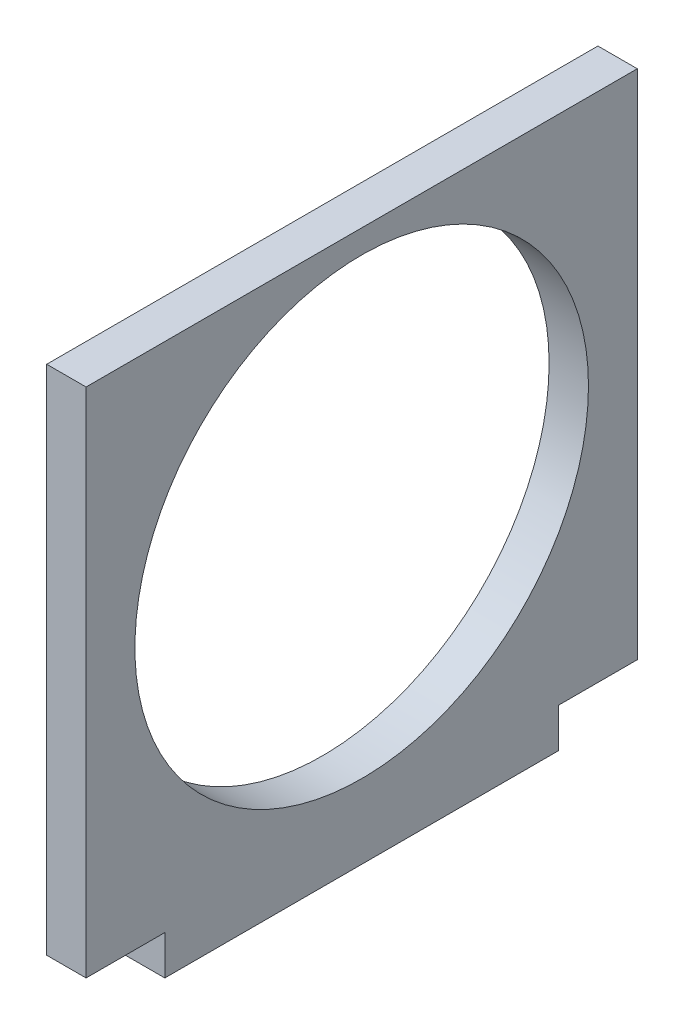
ISO-10303-21;
HEADER;
FILE_DESCRIPTION(('STEP AP214'),'2;1');
FILE_NAME('part.step','',(''),(''),'','','');
FILE_SCHEMA(('AUTOMOTIVE_DESIGN { 1 0 10303 214 1 1 1 1 }'));
ENDSEC;
DATA;
#1=APPLICATION_CONTEXT('core data for automotive mechanical design processes');
#2=APPLICATION_PROTOCOL_DEFINITION('international standard','automotive_design',2000,#1);
#3=PRODUCT_CONTEXT('',#1,'mechanical');
#4=PRODUCT('Part','Part','',(#3));
#5=PRODUCT_RELATED_PRODUCT_CATEGORY('part','',(#4));
#6=PRODUCT_DEFINITION_FORMATION('','',#4);
#7=PRODUCT_DEFINITION_CONTEXT('part definition',#1,'design');
#8=PRODUCT_DEFINITION('design','',#6,#7);
#9=PRODUCT_DEFINITION_SHAPE('','',#8);
#10=(LENGTH_UNIT() NAMED_UNIT(*) SI_UNIT(.MILLI.,.METRE.));
#11=(NAMED_UNIT(*) PLANE_ANGLE_UNIT() SI_UNIT($,.RADIAN.));
#12=(NAMED_UNIT(*) SI_UNIT($,.STERADIAN.) SOLID_ANGLE_UNIT());
#13=UNCERTAINTY_MEASURE_WITH_UNIT(LENGTH_MEASURE(1.E-05),#10,'distance_accuracy_value','');
#14=(GEOMETRIC_REPRESENTATION_CONTEXT(3) GLOBAL_UNCERTAINTY_ASSIGNED_CONTEXT((#13)) GLOBAL_UNIT_ASSIGNED_CONTEXT((#10,
#11,#12)) REPRESENTATION_CONTEXT('',''));
#15=CARTESIAN_POINT('',(0.,0.,0.));
#16=DIRECTION('',(0.,0.,1.));
#17=DIRECTION('',(1.,0.,0.));
#18=AXIS2_PLACEMENT_3D('',#15,#16,#17);
#19=CARTESIAN_POINT('',(3.175,0.,0.));
#20=DIRECTION('',(0.,0.,-1.));
#21=DIRECTION('',(-1.,0.,0.));
#22=AXIS2_PLACEMENT_3D('',#19,#20,#21);
#23=PLANE('',#22);
#24=DIRECTION('',(0.,-1.,0.));
#25=VECTOR('',#24,1.);
#26=CARTESIAN_POINT('',(0.,0.,0.));
#27=LINE('',#26,#25);
#28=CARTESIAN_POINT('',(0.,44.45,0.));
#29=VERTEX_POINT('',#28);
#30=CARTESIAN_POINT('',(0.,3.17499999999999,0.));
#31=VERTEX_POINT('',#30);
#32=EDGE_CURVE('E124',#29,#31,#27,.T.);
#33=ORIENTED_EDGE('',*,*,#32,.T.);
#34=DIRECTION('',(1.,0.,0.));
#35=VECTOR('',#34,1.);
#36=CARTESIAN_POINT('',(0.,3.17499999999999,0.));
#37=LINE('',#36,#35);
#38=CARTESIAN_POINT('',(3.175,3.17499999999999,0.));
#39=VERTEX_POINT('',#38);
#40=EDGE_CURVE('E140',#31,#39,#37,.T.);
#41=ORIENTED_EDGE('',*,*,#40,.T.);
#42=DIRECTION('',(0.,-1.,0.));
#43=VECTOR('',#42,1.);
#44=CARTESIAN_POINT('',(3.175,0.,0.));
#45=LINE('',#44,#43);
#46=CARTESIAN_POINT('',(3.175,44.45,0.));
#47=VERTEX_POINT('',#46);
#48=EDGE_CURVE('E121',#47,#39,#45,.T.);
#49=ORIENTED_EDGE('',*,*,#48,.F.);
#50=DIRECTION('',(-1.,0.,0.));
#51=VECTOR('',#50,1.);
#52=CARTESIAN_POINT('',(3.175,44.45,0.));
#53=LINE('',#52,#51);
#54=EDGE_CURVE('E40',#47,#29,#53,.T.);
#55=ORIENTED_EDGE('',*,*,#54,.T.);
#56=EDGE_LOOP('',(#33,#41,#49,#55));
#57=FACE_BOUND('',#56,.T.);
#58=ADVANCED_FACE('F33',(#57),#23,.F.);
#59=CARTESIAN_POINT('',(3.175,0.,0.));
#60=DIRECTION('',(0.,1.,0.));
#61=DIRECTION('',(0.,0.,1.));
#62=AXIS2_PLACEMENT_3D('',#59,#60,#61);
#63=PLANE('',#62);
#64=DIRECTION('',(0.,0.,-1.));
#65=VECTOR('',#64,1.);
#66=CARTESIAN_POINT('',(0.,0.,0.));
#67=LINE('',#66,#65);
#68=CARTESIAN_POINT('',(0.,0.,-6.35));
#69=VERTEX_POINT('',#68);
#70=CARTESIAN_POINT('',(0.,0.,-38.1));
#71=VERTEX_POINT('',#70);
#72=EDGE_CURVE('E119',#69,#71,#67,.T.);
#73=ORIENTED_EDGE('',*,*,#72,.T.);
#74=DIRECTION('',(1.,0.,0.));
#75=VECTOR('',#74,1.);
#76=CARTESIAN_POINT('',(0.,0.,-38.1));
#77=LINE('',#76,#75);
#78=CARTESIAN_POINT('',(3.175,0.,-38.1));
#79=VERTEX_POINT('',#78);
#80=EDGE_CURVE('E164',#71,#79,#77,.T.);
#81=ORIENTED_EDGE('',*,*,#80,.T.);
#82=DIRECTION('',(0.,0.,-1.));
#83=VECTOR('',#82,1.);
#84=CARTESIAN_POINT('',(3.175,0.,0.));
#85=LINE('',#84,#83);
#86=CARTESIAN_POINT('',(3.175,0.,-6.35));
#87=VERTEX_POINT('',#86);
#88=EDGE_CURVE('E137',#87,#79,#85,.T.);
#89=ORIENTED_EDGE('',*,*,#88,.F.);
#90=DIRECTION('',(1.,0.,0.));
#91=VECTOR('',#90,1.);
#92=CARTESIAN_POINT('',(0.,0.,-6.35));
#93=LINE('',#92,#91);
#94=EDGE_CURVE('E144',#69,#87,#93,.T.);
#95=ORIENTED_EDGE('',*,*,#94,.F.);
#96=EDGE_LOOP('',(#73,#81,#89,#95));
#97=FACE_BOUND('',#96,.T.);
#98=ADVANCED_FACE('F162',(#97),#63,.F.);
#99=CARTESIAN_POINT('',(3.175,0.,-44.45));
#100=DIRECTION('',(0.,0.,1.));
#101=DIRECTION('',(1.,0.,0.));
#102=AXIS2_PLACEMENT_3D('',#99,#100,#101);
#103=PLANE('',#102);
#104=DIRECTION('',(0.,1.,0.));
#105=VECTOR('',#104,1.);
#106=CARTESIAN_POINT('',(3.175,0.,-44.45));
#107=LINE('',#106,#105);
#108=CARTESIAN_POINT('',(3.175,3.175,-44.45));
#109=VERTEX_POINT('',#108);
#110=CARTESIAN_POINT('',(3.175,44.45,-44.45));
#111=VERTEX_POINT('',#110);
#112=EDGE_CURVE('E112',#109,#111,#107,.T.);
#113=ORIENTED_EDGE('',*,*,#112,.F.);
#114=DIRECTION('',(1.,0.,0.));
#115=VECTOR('',#114,1.);
#116=CARTESIAN_POINT('',(0.,3.175,-44.45));
#117=LINE('',#116,#115);
#118=CARTESIAN_POINT('',(0.,3.175,-44.45));
#119=VERTEX_POINT('',#118);
#120=EDGE_CURVE('E100',#119,#109,#117,.T.);
#121=ORIENTED_EDGE('',*,*,#120,.F.);
#122=DIRECTION('',(0.,1.,0.));
#123=VECTOR('',#122,1.);
#124=CARTESIAN_POINT('',(0.,0.,-44.45));
#125=LINE('',#124,#123);
#126=CARTESIAN_POINT('',(0.,44.45,-44.45));
#127=VERTEX_POINT('',#126);
#128=EDGE_CURVE('E111',#119,#127,#125,.T.);
#129=ORIENTED_EDGE('',*,*,#128,.T.);
#130=DIRECTION('',(-1.,0.,0.));
#131=VECTOR('',#130,1.);
#132=CARTESIAN_POINT('',(3.175,44.45,-44.45));
#133=LINE('',#132,#131);
#134=EDGE_CURVE('E11',#111,#127,#133,.T.);
#135=ORIENTED_EDGE('',*,*,#134,.F.);
#136=EDGE_LOOP('',(#113,#121,#129,#135));
#137=FACE_BOUND('',#136,.T.);
#138=ADVANCED_FACE('F109',(#137),#103,.F.);
#139=CARTESIAN_POINT('',(3.175,44.45,0.));
#140=DIRECTION('',(0.,-1.,0.));
#141=DIRECTION('',(0.,0.,-1.));
#142=AXIS2_PLACEMENT_3D('',#139,#140,#141);
#143=PLANE('',#142);
#144=DIRECTION('',(0.,0.,1.));
#145=VECTOR('',#144,1.);
#146=CARTESIAN_POINT('',(0.,44.45,0.));
#147=LINE('',#146,#145);
#148=EDGE_CURVE('E118',#127,#29,#147,.T.);
#149=ORIENTED_EDGE('',*,*,#148,.T.);
#150=ORIENTED_EDGE('',*,*,#54,.F.);
#151=DIRECTION('',(0.,0.,1.));
#152=VECTOR('',#151,1.);
#153=CARTESIAN_POINT('',(3.175,44.45,0.));
#154=LINE('',#153,#152);
#155=EDGE_CURVE('E128',#111,#47,#154,.T.);
#156=ORIENTED_EDGE('',*,*,#155,.F.);
#157=ORIENTED_EDGE('',*,*,#134,.T.);
#158=EDGE_LOOP('',(#149,#150,#156,#157));
#159=FACE_BOUND('',#158,.T.);
#160=ADVANCED_FACE('F190',(#159),#143,.F.);
#161=CARTESIAN_POINT('',(3.175,0.,0.));
#162=DIRECTION('',(-1.,0.,0.));
#163=DIRECTION('',(0.,0.,1.));
#164=AXIS2_PLACEMENT_3D('',#161,#162,#163);
#165=PLANE('',#164);
#166=CARTESIAN_POINT('',(3.175,24.2697,-22.225));
#167=DIRECTION('',(1.,0.,0.));
#168=DIRECTION('',(0.,0.,-1.));
#169=AXIS2_PLACEMENT_3D('',#166,#167,#168);
#170=CIRCLE('',#169,18.288);
#171=CARTESIAN_POINT('',(3.175,24.2697,-40.513));
#172=VERTEX_POINT('',#171);
#173=EDGE_CURVE('E174',#172,#172,#170,.T.);
#174=ORIENTED_EDGE('',*,*,#173,.F.);
#175=EDGE_LOOP('',(#174));
#176=FACE_BOUND('',#175,.T.);
#177=ORIENTED_EDGE('',*,*,#88,.T.);
#178=DIRECTION('',(0.,-1.,0.));
#179=VECTOR('',#178,1.);
#180=CARTESIAN_POINT('',(3.175,0.,-38.1));
#181=LINE('',#180,#179);
#182=CARTESIAN_POINT('',(3.175,3.175,-38.1));
#183=VERTEX_POINT('',#182);
#184=EDGE_CURVE('E105',#183,#79,#181,.T.);
#185=ORIENTED_EDGE('',*,*,#184,.F.);
#186=DIRECTION('',(0.,0.,1.));
#187=VECTOR('',#186,1.);
#188=CARTESIAN_POINT('',(3.175,3.175,-44.45));
#189=LINE('',#188,#187);
#190=EDGE_CURVE('E173',#109,#183,#189,.T.);
#191=ORIENTED_EDGE('',*,*,#190,.F.);
#192=ORIENTED_EDGE('',*,*,#112,.T.);
#193=ORIENTED_EDGE('',*,*,#155,.T.);
#194=ORIENTED_EDGE('',*,*,#48,.T.);
#195=DIRECTION('',(0.,0.,1.));
#196=VECTOR('',#195,1.);
#197=CARTESIAN_POINT('',(3.175,3.17499999999999,0.));
#198=LINE('',#197,#196);
#199=CARTESIAN_POINT('',(3.175,3.17499999999999,-6.35));
#200=VERTEX_POINT('',#199);
#201=EDGE_CURVE('E147',#200,#39,#198,.T.);
#202=ORIENTED_EDGE('',*,*,#201,.F.);
#203=DIRECTION('',(0.,1.,0.));
#204=VECTOR('',#203,1.);
#205=CARTESIAN_POINT('',(3.175,0.,-6.35));
#206=LINE('',#205,#204);
#207=EDGE_CURVE('E158',#87,#200,#206,.T.);
#208=ORIENTED_EDGE('',*,*,#207,.F.);
#209=EDGE_LOOP('',(#177,#185,#191,#192,#193,#194,#202,#208));
#210=FACE_BOUND('',#209,.T.);
#211=ADVANCED_FACE('F155',(#176,#210),#165,.F.);
#212=CARTESIAN_POINT('',(0.,0.,0.));
#213=DIRECTION('',(-1.,0.,0.));
#214=DIRECTION('',(0.,0.,1.));
#215=AXIS2_PLACEMENT_3D('',#212,#213,#214);
#216=PLANE('',#215);
#217=DIRECTION('',(0.,-1.,0.));
#218=VECTOR('',#217,1.);
#219=CARTESIAN_POINT('',(0.,0.,-38.1));
#220=LINE('',#219,#218);
#221=CARTESIAN_POINT('',(0.,3.175,-38.1));
#222=VERTEX_POINT('',#221);
#223=EDGE_CURVE('E47',#222,#71,#220,.T.);
#224=ORIENTED_EDGE('',*,*,#223,.T.);
#225=ORIENTED_EDGE('',*,*,#72,.F.);
#226=DIRECTION('',(0.,1.,0.));
#227=VECTOR('',#226,1.);
#228=CARTESIAN_POINT('',(0.,0.,-6.35));
#229=LINE('',#228,#227);
#230=CARTESIAN_POINT('',(0.,3.17499999999999,-6.35));
#231=VERTEX_POINT('',#230);
#232=EDGE_CURVE('E177',#69,#231,#229,.T.);
#233=ORIENTED_EDGE('',*,*,#232,.T.);
#234=DIRECTION('',(0.,0.,1.));
#235=VECTOR('',#234,1.);
#236=CARTESIAN_POINT('',(0.,3.17499999999999,0.));
#237=LINE('',#236,#235);
#238=EDGE_CURVE('E55',#231,#31,#237,.T.);
#239=ORIENTED_EDGE('',*,*,#238,.T.);
#240=ORIENTED_EDGE('',*,*,#32,.F.);
#241=ORIENTED_EDGE('',*,*,#148,.F.);
#242=ORIENTED_EDGE('',*,*,#128,.F.);
#243=DIRECTION('',(0.,0.,1.));
#244=VECTOR('',#243,1.);
#245=CARTESIAN_POINT('',(0.,3.175,-44.45));
#246=LINE('',#245,#244);
#247=EDGE_CURVE('E96',#119,#222,#246,.T.);
#248=ORIENTED_EDGE('',*,*,#247,.T.);
#249=EDGE_LOOP('',(#224,#225,#233,#239,#240,#241,#242,#248));
#250=FACE_BOUND('',#249,.T.);
#251=CARTESIAN_POINT('',(0.,24.2697,-22.225));
#252=DIRECTION('',(1.,0.,0.));
#253=DIRECTION('',(0.,0.,-1.));
#254=AXIS2_PLACEMENT_3D('',#251,#252,#253);
#255=CIRCLE('',#254,18.288);
#256=CARTESIAN_POINT('',(0.,24.2697,-40.513));
#257=VERTEX_POINT('',#256);
#258=EDGE_CURVE('E170',#257,#257,#255,.T.);
#259=ORIENTED_EDGE('',*,*,#258,.T.);
#260=EDGE_LOOP('',(#259));
#261=FACE_BOUND('',#260,.T.);
#262=ADVANCED_FACE('F115',(#250,#261),#216,.T.);
#263=CARTESIAN_POINT('',(0.,3.17499999999999,0.));
#264=DIRECTION('',(0.,1.,0.));
#265=DIRECTION('',(0.,0.,1.));
#266=AXIS2_PLACEMENT_3D('',#263,#264,#265);
#267=PLANE('',#266);
#268=ORIENTED_EDGE('',*,*,#201,.T.);
#269=ORIENTED_EDGE('',*,*,#40,.F.);
#270=ORIENTED_EDGE('',*,*,#238,.F.);
#271=DIRECTION('',(1.,0.,0.));
#272=VECTOR('',#271,1.);
#273=CARTESIAN_POINT('',(0.,3.17499999999999,-6.35));
#274=LINE('',#273,#272);
#275=EDGE_CURVE('E142',#231,#200,#274,.T.);
#276=ORIENTED_EDGE('',*,*,#275,.T.);
#277=EDGE_LOOP('',(#268,#269,#270,#276));
#278=FACE_BOUND('',#277,.T.);
#279=ADVANCED_FACE('F182',(#278),#267,.F.);
#280=CARTESIAN_POINT('',(0.,0.,-6.35));
#281=DIRECTION('',(0.,0.,-1.));
#282=DIRECTION('',(-1.,0.,0.));
#283=AXIS2_PLACEMENT_3D('',#280,#281,#282);
#284=PLANE('',#283);
#285=ORIENTED_EDGE('',*,*,#207,.T.);
#286=ORIENTED_EDGE('',*,*,#275,.F.);
#287=ORIENTED_EDGE('',*,*,#232,.F.);
#288=ORIENTED_EDGE('',*,*,#94,.T.);
#289=EDGE_LOOP('',(#285,#286,#287,#288));
#290=FACE_BOUND('',#289,.T.);
#291=ADVANCED_FACE('F181',(#290),#284,.F.);
#292=CARTESIAN_POINT('',(0.,24.2697,-22.225));
#293=DIRECTION('',(1.,0.,0.));
#294=DIRECTION('',(0.,0.,-1.));
#295=AXIS2_PLACEMENT_3D('',#292,#293,#294);
#296=CYLINDRICAL_SURFACE('',#295,18.288);
#297=ORIENTED_EDGE('',*,*,#258,.F.);
#298=EDGE_LOOP('',(#297));
#299=FACE_BOUND('',#298,.T.);
#300=ORIENTED_EDGE('',*,*,#173,.T.);
#301=EDGE_LOOP('',(#300));
#302=FACE_BOUND('',#301,.T.);
#303=ADVANCED_FACE('F203',(#299,#302),#296,.F.);
#304=CARTESIAN_POINT('',(0.,0.,-38.1));
#305=DIRECTION('',(0.,0.,1.));
#306=DIRECTION('',(1.,0.,0.));
#307=AXIS2_PLACEMENT_3D('',#304,#305,#306);
#308=PLANE('',#307);
#309=ORIENTED_EDGE('',*,*,#184,.T.);
#310=ORIENTED_EDGE('',*,*,#80,.F.);
#311=ORIENTED_EDGE('',*,*,#223,.F.);
#312=DIRECTION('',(1.,0.,0.));
#313=VECTOR('',#312,1.);
#314=CARTESIAN_POINT('',(0.,3.175,-38.1));
#315=LINE('',#314,#313);
#316=EDGE_CURVE('E102',#222,#183,#315,.T.);
#317=ORIENTED_EDGE('',*,*,#316,.T.);
#318=EDGE_LOOP('',(#309,#310,#311,#317));
#319=FACE_BOUND('',#318,.T.);
#320=ADVANCED_FACE('F208',(#319),#308,.F.);
#321=CARTESIAN_POINT('',(0.,3.175,-44.45));
#322=DIRECTION('',(0.,1.,0.));
#323=DIRECTION('',(0.,0.,1.));
#324=AXIS2_PLACEMENT_3D('',#321,#322,#323);
#325=PLANE('',#324);
#326=ORIENTED_EDGE('',*,*,#190,.T.);
#327=ORIENTED_EDGE('',*,*,#316,.F.);
#328=ORIENTED_EDGE('',*,*,#247,.F.);
#329=ORIENTED_EDGE('',*,*,#120,.T.);
#330=EDGE_LOOP('',(#326,#327,#328,#329));
#331=FACE_BOUND('',#330,.T.);
#332=ADVANCED_FACE('F99',(#331),#325,.F.);
#333=CLOSED_SHELL('',(#58,#98,#138,#160,#211,#262,#279,#291,#303,#320,#332));
#334=MANIFOLD_SOLID_BREP('B2',#333);
#335=ADVANCED_BREP_SHAPE_REPRESENTATION('',(#18,#334),#14);
#336=SHAPE_DEFINITION_REPRESENTATION(#9,#335);
ENDSEC;
END-ISO-10303-21;
